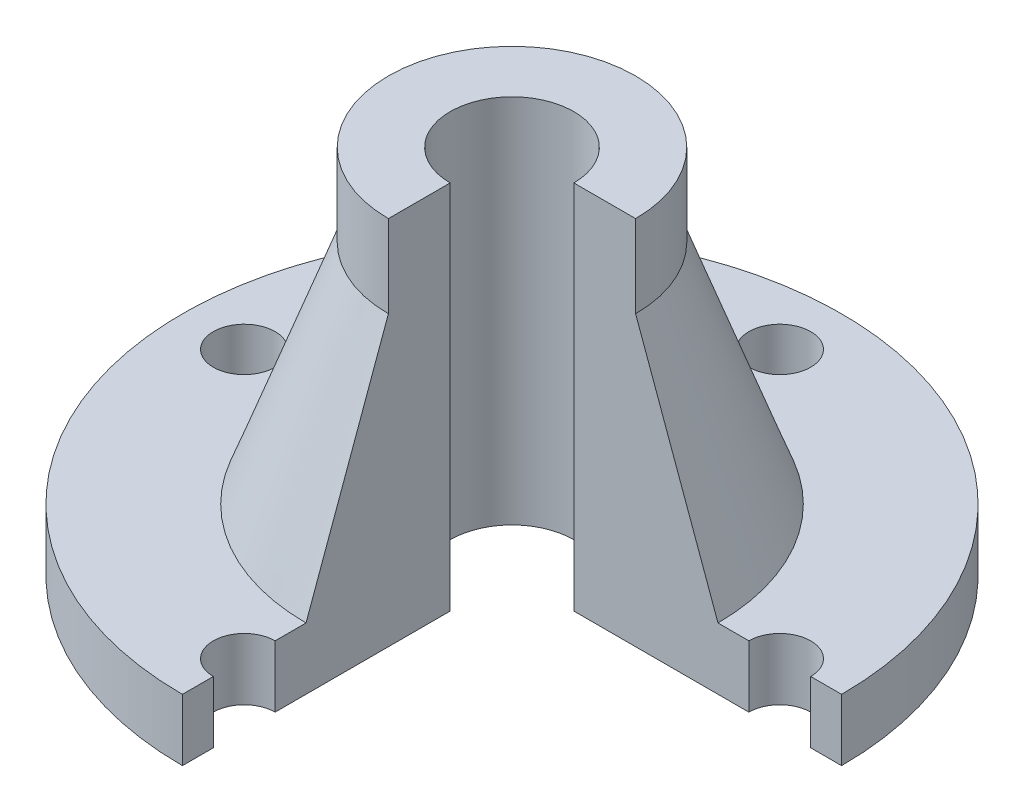
ISO-10303-21;
HEADER;
FILE_DESCRIPTION(('STEP AP214'),'2;1');
FILE_NAME('part.step','',(''),(''),'','','');
FILE_SCHEMA(('AUTOMOTIVE_DESIGN { 1 0 10303 214 1 1 1 1 }'));
ENDSEC;
DATA;
#1=APPLICATION_CONTEXT('core data for automotive mechanical design processes');
#2=APPLICATION_PROTOCOL_DEFINITION('international standard','automotive_design',2000,#1);
#3=PRODUCT_CONTEXT('',#1,'mechanical');
#4=PRODUCT('Part','Part','',(#3));
#5=PRODUCT_RELATED_PRODUCT_CATEGORY('part','',(#4));
#6=PRODUCT_DEFINITION_FORMATION('','',#4);
#7=PRODUCT_DEFINITION_CONTEXT('part definition',#1,'design');
#8=PRODUCT_DEFINITION('design','',#6,#7);
#9=PRODUCT_DEFINITION_SHAPE('','',#8);
#10=(LENGTH_UNIT() NAMED_UNIT(*) SI_UNIT(.MILLI.,.METRE.));
#11=(NAMED_UNIT(*) PLANE_ANGLE_UNIT() SI_UNIT($,.RADIAN.));
#12=(NAMED_UNIT(*) SI_UNIT($,.STERADIAN.) SOLID_ANGLE_UNIT());
#13=UNCERTAINTY_MEASURE_WITH_UNIT(LENGTH_MEASURE(1.E-05),#10,'distance_accuracy_value','');
#14=(GEOMETRIC_REPRESENTATION_CONTEXT(3) GLOBAL_UNCERTAINTY_ASSIGNED_CONTEXT((#13)) GLOBAL_UNIT_ASSIGNED_CONTEXT((#10,
#11,#12)) REPRESENTATION_CONTEXT('',''));
#15=CARTESIAN_POINT('',(0.,0.,0.));
#16=DIRECTION('',(0.,0.,1.));
#17=DIRECTION('',(1.,0.,0.));
#18=AXIS2_PLACEMENT_3D('',#15,#16,#17);
#19=CARTESIAN_POINT('',(0.,15.,0.));
#20=DIRECTION('',(0.,-1.,0.));
#21=DIRECTION('',(0.,0.,-1.));
#22=AXIS2_PLACEMENT_3D('',#19,#20,#21);
#23=CYLINDRICAL_SURFACE('',#22,80.);
#24=CARTESIAN_POINT('',(0.,15.,0.));
#25=DIRECTION('',(0.,1.,0.));
#26=DIRECTION('',(0.,0.,1.));
#27=AXIS2_PLACEMENT_3D('',#24,#25,#26);
#28=CIRCLE('',#27,80.);
#29=CARTESIAN_POINT('',(80.,15.,0.));
#30=VERTEX_POINT('',#29);
#31=CARTESIAN_POINT('',(0.,15.,80.));
#32=VERTEX_POINT('',#31);
#33=EDGE_CURVE('E144',#30,#32,#28,.T.);
#34=ORIENTED_EDGE('',*,*,#33,.F.);
#35=DIRECTION('',(0.,-1.,0.));
#36=VECTOR('',#35,1.);
#37=CARTESIAN_POINT('',(80.,90.,0.));
#38=LINE('',#37,#36);
#39=CARTESIAN_POINT('',(80.,0.,0.));
#40=VERTEX_POINT('',#39);
#41=EDGE_CURVE('E127',#30,#40,#38,.T.);
#42=ORIENTED_EDGE('',*,*,#41,.T.);
#43=CARTESIAN_POINT('',(0.,0.,0.));
#44=DIRECTION('',(0.,1.,0.));
#45=DIRECTION('',(0.,0.,1.));
#46=AXIS2_PLACEMENT_3D('',#43,#44,#45);
#47=CIRCLE('',#46,80.);
#48=CARTESIAN_POINT('',(0.,0.,80.));
#49=VERTEX_POINT('',#48);
#50=EDGE_CURVE('E136',#40,#49,#47,.T.);
#51=ORIENTED_EDGE('',*,*,#50,.T.);
#52=DIRECTION('',(0.,-1.,0.));
#53=VECTOR('',#52,1.);
#54=CARTESIAN_POINT('',(0.,90.,80.));
#55=LINE('',#54,#53);
#56=EDGE_CURVE('E116',#32,#49,#55,.T.);
#57=ORIENTED_EDGE('',*,*,#56,.F.);
#58=EDGE_LOOP('',(#34,#42,#51,#57));
#59=FACE_BOUND('',#58,.T.);
#60=ADVANCED_FACE('F36',(#59),#23,.T.);
#61=CARTESIAN_POINT('',(0.,15.,0.));
#62=DIRECTION('',(0.,1.,0.));
#63=DIRECTION('',(0.,0.,1.));
#64=AXIS2_PLACEMENT_3D('',#61,#62,#63);
#65=PLANE('',#64);
#66=DIRECTION('',(-1.,0.,0.));
#67=VECTOR('',#66,1.);
#68=CARTESIAN_POINT('',(0.,15.,0.));
#69=LINE('',#68,#67);
#70=CARTESIAN_POINT('',(72.5,15.,0.));
#71=VERTEX_POINT('',#70);
#72=EDGE_CURVE('E58',#30,#71,#69,.T.);
#73=ORIENTED_EDGE('',*,*,#72,.F.);
#74=ORIENTED_EDGE('',*,*,#33,.T.);
#75=DIRECTION('',(0.,0.,1.));
#76=VECTOR('',#75,1.);
#77=CARTESIAN_POINT('',(0.,15.,0.));
#78=LINE('',#77,#76);
#79=CARTESIAN_POINT('',(0.,15.,72.5));
#80=VERTEX_POINT('',#79);
#81=EDGE_CURVE('E122',#80,#32,#78,.T.);
#82=ORIENTED_EDGE('',*,*,#81,.F.);
#83=CARTESIAN_POINT('',(0.,15.,65.));
#84=DIRECTION('',(0.,1.,0.));
#85=DIRECTION('',(0.,0.,1.));
#86=AXIS2_PLACEMENT_3D('',#83,#84,#85);
#87=CIRCLE('',#86,7.5);
#88=CARTESIAN_POINT('',(0.,15.,57.5));
#89=VERTEX_POINT('',#88);
#90=EDGE_CURVE('E176',#89,#80,#87,.T.);
#91=ORIENTED_EDGE('',*,*,#90,.F.);
#92=CARTESIAN_POINT('',(0.,15.,50.));
#93=VERTEX_POINT('',#92);
#94=EDGE_CURVE('E367',#93,#89,#78,.T.);
#95=ORIENTED_EDGE('',*,*,#94,.F.);
#96=CARTESIAN_POINT('',(0.,15.,0.));
#97=DIRECTION('',(0.,1.,0.));
#98=DIRECTION('',(0.,0.,1.));
#99=AXIS2_PLACEMENT_3D('',#96,#97,#98);
#100=CIRCLE('',#99,50.);
#101=CARTESIAN_POINT('',(50.,15.,0.));
#102=VERTEX_POINT('',#101);
#103=EDGE_CURVE('E188',#102,#93,#100,.T.);
#104=ORIENTED_EDGE('',*,*,#103,.F.);
#105=CARTESIAN_POINT('',(57.5,15.,0.));
#106=VERTEX_POINT('',#105);
#107=EDGE_CURVE('E204',#106,#102,#69,.T.);
#108=ORIENTED_EDGE('',*,*,#107,.F.);
#109=CARTESIAN_POINT('',(65.,15.,-6.80838861074411E-13));
#110=DIRECTION('',(0.,1.,0.));
#111=DIRECTION('',(0.,0.,1.));
#112=AXIS2_PLACEMENT_3D('',#109,#110,#111);
#113=CIRCLE('',#112,7.5);
#114=EDGE_CURVE('E164',#71,#106,#113,.T.);
#115=ORIENTED_EDGE('',*,*,#114,.F.);
#116=EDGE_LOOP('',(#73,#74,#82,#91,#95,#104,#108,#115));
#117=FACE_BOUND('',#116,.T.);
#118=CARTESIAN_POINT('',(-65.,15.,2.26946287024804E-13));
#119=DIRECTION('',(0.,1.,0.));
#120=DIRECTION('',(0.,0.,1.));
#121=AXIS2_PLACEMENT_3D('',#118,#119,#120);
#122=CIRCLE('',#121,7.5);
#123=CARTESIAN_POINT('',(-65.,15.,7.50000000000023));
#124=VERTEX_POINT('',#123);
#125=EDGE_CURVE('E179',#124,#124,#122,.T.);
#126=ORIENTED_EDGE('',*,*,#125,.F.);
#127=EDGE_LOOP('',(#126));
#128=FACE_BOUND('',#127,.T.);
#129=CARTESIAN_POINT('',(0.,15.,-65.));
#130=DIRECTION('',(0.,1.,0.));
#131=DIRECTION('',(0.,0.,1.));
#132=AXIS2_PLACEMENT_3D('',#129,#130,#131);
#133=CIRCLE('',#132,7.5);
#134=CARTESIAN_POINT('',(0.,15.,-57.5));
#135=VERTEX_POINT('',#134);
#136=EDGE_CURVE('E185',#135,#135,#133,.T.);
#137=ORIENTED_EDGE('',*,*,#136,.F.);
#138=EDGE_LOOP('',(#137));
#139=FACE_BOUND('',#138,.T.);
#140=ADVANCED_FACE('F225',(#117,#128,#139),#65,.T.);
#141=CARTESIAN_POINT('',(0.,0.,0.));
#142=DIRECTION('',(0.,1.,0.));
#143=DIRECTION('',(0.,0.,1.));
#144=AXIS2_PLACEMENT_3D('',#141,#142,#143);
#145=PLANE('',#144);
#146=CARTESIAN_POINT('',(-65.,0.,2.26946287024804E-13));
#147=DIRECTION('',(0.,-1.,0.));
#148=DIRECTION('',(-1.,0.,0.));
#149=AXIS2_PLACEMENT_3D('',#146,#147,#148);
#150=CIRCLE('',#149,7.5);
#151=CARTESIAN_POINT('',(-72.5,0.,2.53132397066127E-13));
#152=VERTEX_POINT('',#151);
#153=EDGE_CURVE('E170',#152,#152,#150,.T.);
#154=ORIENTED_EDGE('',*,*,#153,.F.);
#155=EDGE_LOOP('',(#154));
#156=FACE_BOUND('',#155,.T.);
#157=ORIENTED_EDGE('',*,*,#50,.F.);
#158=DIRECTION('',(1.,0.,0.));
#159=VECTOR('',#158,1.);
#160=CARTESIAN_POINT('',(0.,0.,0.));
#161=LINE('',#160,#159);
#162=CARTESIAN_POINT('',(72.5,0.,0.));
#163=VERTEX_POINT('',#162);
#164=EDGE_CURVE('E140',#163,#40,#161,.T.);
#165=ORIENTED_EDGE('',*,*,#164,.F.);
#166=CARTESIAN_POINT('',(65.,0.,-6.80838861074411E-13));
#167=DIRECTION('',(0.,-1.,0.));
#168=DIRECTION('',(1.,0.,0.));
#169=AXIS2_PLACEMENT_3D('',#166,#167,#168);
#170=CIRCLE('',#169,7.5);
#171=CARTESIAN_POINT('',(57.5,0.,0.));
#172=VERTEX_POINT('',#171);
#173=EDGE_CURVE('E162',#172,#163,#170,.T.);
#174=ORIENTED_EDGE('',*,*,#173,.F.);
#175=CARTESIAN_POINT('',(15.,0.,0.));
#176=VERTEX_POINT('',#175);
#177=EDGE_CURVE('E50',#176,#172,#161,.T.);
#178=ORIENTED_EDGE('',*,*,#177,.F.);
#179=CARTESIAN_POINT('',(0.,0.,0.));
#180=DIRECTION('',(0.,1.,0.));
#181=DIRECTION('',(0.,0.,1.));
#182=AXIS2_PLACEMENT_3D('',#179,#180,#181);
#183=CIRCLE('',#182,15.);
#184=CARTESIAN_POINT('',(0.,0.,15.));
#185=VERTEX_POINT('',#184);
#186=EDGE_CURVE('E150',#176,#185,#183,.T.);
#187=ORIENTED_EDGE('',*,*,#186,.T.);
#188=DIRECTION('',(0.,0.,-1.));
#189=VECTOR('',#188,1.);
#190=CARTESIAN_POINT('',(0.,0.,80.));
#191=LINE('',#190,#189);
#192=CARTESIAN_POINT('',(0.,0.,57.5));
#193=VERTEX_POINT('',#192);
#194=EDGE_CURVE('E141',#193,#185,#191,.T.);
#195=ORIENTED_EDGE('',*,*,#194,.F.);
#196=CARTESIAN_POINT('',(0.,0.,65.));
#197=DIRECTION('',(0.,-1.,0.));
#198=DIRECTION('',(0.,0.,1.));
#199=AXIS2_PLACEMENT_3D('',#196,#197,#198);
#200=CIRCLE('',#199,7.5);
#201=CARTESIAN_POINT('',(0.,0.,72.5));
#202=VERTEX_POINT('',#201);
#203=EDGE_CURVE('E139',#202,#193,#200,.T.);
#204=ORIENTED_EDGE('',*,*,#203,.F.);
#205=EDGE_CURVE('E119',#49,#202,#191,.T.);
#206=ORIENTED_EDGE('',*,*,#205,.F.);
#207=EDGE_LOOP('',(#157,#165,#174,#178,#187,#195,#204,#206));
#208=FACE_BOUND('',#207,.T.);
#209=CARTESIAN_POINT('',(0.,0.,-65.));
#210=DIRECTION('',(0.,-1.,0.));
#211=DIRECTION('',(0.,0.,-1.));
#212=AXIS2_PLACEMENT_3D('',#209,#210,#211);
#213=CIRCLE('',#212,7.5);
#214=CARTESIAN_POINT('',(0.,0.,-72.5));
#215=VERTEX_POINT('',#214);
#216=EDGE_CURVE('E182',#215,#215,#213,.T.);
#217=ORIENTED_EDGE('',*,*,#216,.F.);
#218=EDGE_LOOP('',(#217));
#219=FACE_BOUND('',#218,.T.);
#220=ADVANCED_FACE('F133',(#156,#208,#219),#145,.F.);
#221=CARTESIAN_POINT('',(0.,90.,0.));
#222=DIRECTION('',(0.,1.,0.));
#223=DIRECTION('',(0.,0.,1.));
#224=AXIS2_PLACEMENT_3D('',#221,#222,#223);
#225=PLANE('',#224);
#226=DIRECTION('',(1.,0.,0.));
#227=VECTOR('',#226,1.);
#228=CARTESIAN_POINT('',(0.,90.,0.));
#229=LINE('',#228,#227);
#230=CARTESIAN_POINT('',(15.,90.,0.));
#231=VERTEX_POINT('',#230);
#232=CARTESIAN_POINT('',(30.,90.,0.));
#233=VERTEX_POINT('',#232);
#234=EDGE_CURVE('E128',#231,#233,#229,.T.);
#235=ORIENTED_EDGE('',*,*,#234,.T.);
#236=CARTESIAN_POINT('',(0.,90.,0.));
#237=DIRECTION('',(0.,1.,0.));
#238=DIRECTION('',(0.,0.,1.));
#239=AXIS2_PLACEMENT_3D('',#236,#237,#238);
#240=CIRCLE('',#239,30.);
#241=CARTESIAN_POINT('',(0.,90.,30.));
#242=VERTEX_POINT('',#241);
#243=EDGE_CURVE('E194',#233,#242,#240,.T.);
#244=ORIENTED_EDGE('',*,*,#243,.T.);
#245=DIRECTION('',(0.,0.,-1.));
#246=VECTOR('',#245,1.);
#247=CARTESIAN_POINT('',(0.,90.,80.));
#248=LINE('',#247,#246);
#249=CARTESIAN_POINT('',(0.,90.,15.));
#250=VERTEX_POINT('',#249);
#251=EDGE_CURVE('E361',#242,#250,#248,.T.);
#252=ORIENTED_EDGE('',*,*,#251,.T.);
#253=CARTESIAN_POINT('',(0.,90.,0.));
#254=DIRECTION('',(0.,1.,0.));
#255=DIRECTION('',(0.,0.,1.));
#256=AXIS2_PLACEMENT_3D('',#253,#254,#255);
#257=CIRCLE('',#256,15.);
#258=EDGE_CURVE('E145',#231,#250,#257,.T.);
#259=ORIENTED_EDGE('',*,*,#258,.F.);
#260=EDGE_LOOP('',(#235,#244,#252,#259));
#261=FACE_BOUND('',#260,.T.);
#262=ADVANCED_FACE('F224',(#261),#225,.T.);
#263=CARTESIAN_POINT('',(0.,90.,0.));
#264=DIRECTION('',(0.,-1.,0.));
#265=DIRECTION('',(0.,0.,-1.));
#266=AXIS2_PLACEMENT_3D('',#263,#264,#265);
#267=CYLINDRICAL_SURFACE('',#266,15.);
#268=DIRECTION('',(0.,-1.,0.));
#269=VECTOR('',#268,1.);
#270=CARTESIAN_POINT('',(15.,90.,0.));
#271=LINE('',#270,#269);
#272=EDGE_CURVE('E168',#231,#176,#271,.T.);
#273=ORIENTED_EDGE('',*,*,#272,.F.);
#274=ORIENTED_EDGE('',*,*,#258,.T.);
#275=DIRECTION('',(0.,-1.,0.));
#276=VECTOR('',#275,1.);
#277=CARTESIAN_POINT('',(0.,90.,15.));
#278=LINE('',#277,#276);
#279=EDGE_CURVE('E201',#185,#250,#278,.F.);
#280=ORIENTED_EDGE('',*,*,#279,.F.);
#281=ORIENTED_EDGE('',*,*,#186,.F.);
#282=EDGE_LOOP('',(#273,#274,#280,#281));
#283=FACE_BOUND('',#282,.T.);
#284=ADVANCED_FACE('F199',(#283),#267,.F.);
#285=CARTESIAN_POINT('',(0.,90.,0.));
#286=DIRECTION('',(0.,1.,0.));
#287=DIRECTION('',(0.,0.,1.));
#288=AXIS2_PLACEMENT_3D('',#285,#286,#287);
#289=CYLINDRICAL_SURFACE('',#288,30.);
#290=ORIENTED_EDGE('',*,*,#243,.F.);
#291=DIRECTION('',(0.,1.,0.));
#292=VECTOR('',#291,1.);
#293=CARTESIAN_POINT('',(30.,90.,0.));
#294=LINE('',#293,#292);
#295=CARTESIAN_POINT('',(30.,70.,0.));
#296=VERTEX_POINT('',#295);
#297=EDGE_CURVE('E216',#233,#296,#294,.F.);
#298=ORIENTED_EDGE('',*,*,#297,.T.);
#299=CARTESIAN_POINT('',(0.,70.,0.));
#300=DIRECTION('',(0.,1.,0.));
#301=DIRECTION('',(0.,0.,1.));
#302=AXIS2_PLACEMENT_3D('',#299,#300,#301);
#303=CIRCLE('',#302,30.);
#304=CARTESIAN_POINT('',(0.,70.,30.));
#305=VERTEX_POINT('',#304);
#306=EDGE_CURVE('E191',#296,#305,#303,.T.);
#307=ORIENTED_EDGE('',*,*,#306,.T.);
#308=DIRECTION('',(0.,1.,0.));
#309=VECTOR('',#308,1.);
#310=CARTESIAN_POINT('',(0.,90.,30.));
#311=LINE('',#310,#309);
#312=EDGE_CURVE('E205',#305,#242,#311,.T.);
#313=ORIENTED_EDGE('',*,*,#312,.T.);
#314=EDGE_LOOP('',(#290,#298,#307,#313));
#315=FACE_BOUND('',#314,.T.);
#316=ADVANCED_FACE('F261',(#315),#289,.T.);
#317=CARTESIAN_POINT('',(0.,15.,0.));
#318=DIRECTION('',(0.,-1.,0.));
#319=DIRECTION('',(0.,0.,-1.));
#320=AXIS2_PLACEMENT_3D('',#317,#318,#319);
#321=CONICAL_SURFACE('',#320,50.,0.348771003583907);
#322=ORIENTED_EDGE('',*,*,#306,.F.);
#323=DIRECTION('',(0.341743063086705,-0.939793423488437,0.));
#324=VECTOR('',#323,1.);
#325=CARTESIAN_POINT('',(0.,152.5,0.));
#326=LINE('',#325,#324);
#327=EDGE_CURVE('E207',#296,#102,#326,.T.);
#328=ORIENTED_EDGE('',*,*,#327,.T.);
#329=ORIENTED_EDGE('',*,*,#103,.T.);
#330=DIRECTION('',(0.,0.939793423488437,-0.341743063086705));
#331=VECTOR('',#330,1.);
#332=CARTESIAN_POINT('',(0.,152.5,0.));
#333=LINE('',#332,#331);
#334=EDGE_CURVE('E210',#93,#305,#333,.T.);
#335=ORIENTED_EDGE('',*,*,#334,.T.);
#336=EDGE_LOOP('',(#322,#328,#329,#335));
#337=FACE_BOUND('',#336,.T.);
#338=ADVANCED_FACE('F270',(#337),#321,.T.);
#339=CARTESIAN_POINT('',(0.,75.,-65.));
#340=DIRECTION('',(0.,-1.,0.));
#341=DIRECTION('',(0.,0.,-1.));
#342=AXIS2_PLACEMENT_3D('',#339,#340,#341);
#343=CYLINDRICAL_SURFACE('',#342,7.5);
#344=ORIENTED_EDGE('',*,*,#136,.T.);
#345=EDGE_LOOP('',(#344));
#346=FACE_BOUND('',#345,.T.);
#347=ORIENTED_EDGE('',*,*,#216,.T.);
#348=EDGE_LOOP('',(#347));
#349=FACE_BOUND('',#348,.T.);
#350=ADVANCED_FACE('F280',(#346,#349),#343,.F.);
#351=CARTESIAN_POINT('',(65.,75.,-6.80838861074411E-13));
#352=DIRECTION('',(0.,-1.,0.));
#353=DIRECTION('',(0.,0.,-1.));
#354=AXIS2_PLACEMENT_3D('',#351,#352,#353);
#355=CYLINDRICAL_SURFACE('',#354,7.5);
#356=ORIENTED_EDGE('',*,*,#173,.T.);
#357=DIRECTION('',(0.,-1.,0.));
#358=VECTOR('',#357,1.);
#359=CARTESIAN_POINT('',(72.5,75.,0.));
#360=LINE('',#359,#358);
#361=EDGE_CURVE('E11',#163,#71,#360,.F.);
#362=ORIENTED_EDGE('',*,*,#361,.T.);
#363=ORIENTED_EDGE('',*,*,#114,.T.);
#364=DIRECTION('',(0.,-1.,0.));
#365=VECTOR('',#364,1.);
#366=CARTESIAN_POINT('',(57.5,75.,0.));
#367=LINE('',#366,#365);
#368=EDGE_CURVE('E43',#106,#172,#367,.T.);
#369=ORIENTED_EDGE('',*,*,#368,.T.);
#370=EDGE_LOOP('',(#356,#362,#363,#369));
#371=FACE_BOUND('',#370,.T.);
#372=ADVANCED_FACE('F161',(#371),#355,.F.);
#373=CARTESIAN_POINT('',(0.,75.,65.));
#374=DIRECTION('',(0.,-1.,0.));
#375=DIRECTION('',(0.,0.,-1.));
#376=AXIS2_PLACEMENT_3D('',#373,#374,#375);
#377=CYLINDRICAL_SURFACE('',#376,7.5);
#378=ORIENTED_EDGE('',*,*,#203,.T.);
#379=DIRECTION('',(0.,-1.,0.));
#380=VECTOR('',#379,1.);
#381=CARTESIAN_POINT('',(0.,75.,57.5));
#382=LINE('',#381,#380);
#383=EDGE_CURVE('E155',#193,#89,#382,.F.);
#384=ORIENTED_EDGE('',*,*,#383,.T.);
#385=ORIENTED_EDGE('',*,*,#90,.T.);
#386=DIRECTION('',(0.,-1.,0.));
#387=VECTOR('',#386,1.);
#388=CARTESIAN_POINT('',(0.,75.,72.5));
#389=LINE('',#388,#387);
#390=EDGE_CURVE('E147',#80,#202,#389,.T.);
#391=ORIENTED_EDGE('',*,*,#390,.T.);
#392=EDGE_LOOP('',(#378,#384,#385,#391));
#393=FACE_BOUND('',#392,.T.);
#394=ADVANCED_FACE('F292',(#393),#377,.F.);
#395=CARTESIAN_POINT('',(-65.,75.,2.26946287024804E-13));
#396=DIRECTION('',(0.,-1.,0.));
#397=DIRECTION('',(0.,0.,-1.));
#398=AXIS2_PLACEMENT_3D('',#395,#396,#397);
#399=CYLINDRICAL_SURFACE('',#398,7.5);
#400=ORIENTED_EDGE('',*,*,#125,.T.);
#401=EDGE_LOOP('',(#400));
#402=FACE_BOUND('',#401,.T.);
#403=ORIENTED_EDGE('',*,*,#153,.T.);
#404=EDGE_LOOP('',(#403));
#405=FACE_BOUND('',#404,.T.);
#406=ADVANCED_FACE('F221',(#402,#405),#399,.F.);
#407=CARTESIAN_POINT('',(0.,90.,80.));
#408=DIRECTION('',(-1.,0.,0.));
#409=DIRECTION('',(0.,0.,1.));
#410=AXIS2_PLACEMENT_3D('',#407,#408,#409);
#411=PLANE('',#410);
#412=ORIENTED_EDGE('',*,*,#81,.T.);
#413=ORIENTED_EDGE('',*,*,#56,.T.);
#414=ORIENTED_EDGE('',*,*,#205,.T.);
#415=ORIENTED_EDGE('',*,*,#390,.F.);
#416=EDGE_LOOP('',(#412,#413,#414,#415));
#417=FACE_BOUND('',#416,.T.);
#418=ADVANCED_FACE('F118',(#417),#411,.F.);
#419=ORIENTED_EDGE('',*,*,#279,.T.);
#420=ORIENTED_EDGE('',*,*,#251,.F.);
#421=ORIENTED_EDGE('',*,*,#312,.F.);
#422=ORIENTED_EDGE('',*,*,#334,.F.);
#423=ORIENTED_EDGE('',*,*,#94,.T.);
#424=ORIENTED_EDGE('',*,*,#383,.F.);
#425=ORIENTED_EDGE('',*,*,#194,.T.);
#426=EDGE_LOOP('',(#419,#420,#421,#422,#423,#424,#425));
#427=FACE_BOUND('',#426,.T.);
#428=ADVANCED_FACE('F312',(#427),#411,.F.);
#429=CARTESIAN_POINT('',(0.,90.,0.));
#430=DIRECTION('',(0.,0.,-1.));
#431=DIRECTION('',(-1.,0.,0.));
#432=AXIS2_PLACEMENT_3D('',#429,#430,#431);
#433=PLANE('',#432);
#434=ORIENTED_EDGE('',*,*,#272,.T.);
#435=ORIENTED_EDGE('',*,*,#177,.T.);
#436=ORIENTED_EDGE('',*,*,#368,.F.);
#437=ORIENTED_EDGE('',*,*,#107,.T.);
#438=ORIENTED_EDGE('',*,*,#327,.F.);
#439=ORIENTED_EDGE('',*,*,#297,.F.);
#440=ORIENTED_EDGE('',*,*,#234,.F.);
#441=EDGE_LOOP('',(#434,#435,#436,#437,#438,#439,#440));
#442=FACE_BOUND('',#441,.T.);
#443=ADVANCED_FACE('F321',(#442),#433,.F.);
#444=ORIENTED_EDGE('',*,*,#72,.T.);
#445=ORIENTED_EDGE('',*,*,#361,.F.);
#446=ORIENTED_EDGE('',*,*,#164,.T.);
#447=ORIENTED_EDGE('',*,*,#41,.F.);
#448=EDGE_LOOP('',(#444,#445,#446,#447));
#449=FACE_BOUND('',#448,.T.);
#450=ADVANCED_FACE('F329',(#449),#433,.F.);
#451=CLOSED_SHELL('',(#60,#140,#220,#262,#284,#316,#338,#350,#372,#394,#406,#418,#428,#443,#450));
#452=MANIFOLD_SOLID_BREP('B2',#451);
#453=ADVANCED_BREP_SHAPE_REPRESENTATION('',(#18,#452),#14);
#454=SHAPE_DEFINITION_REPRESENTATION(#9,#453);
ENDSEC;
END-ISO-10303-21;
